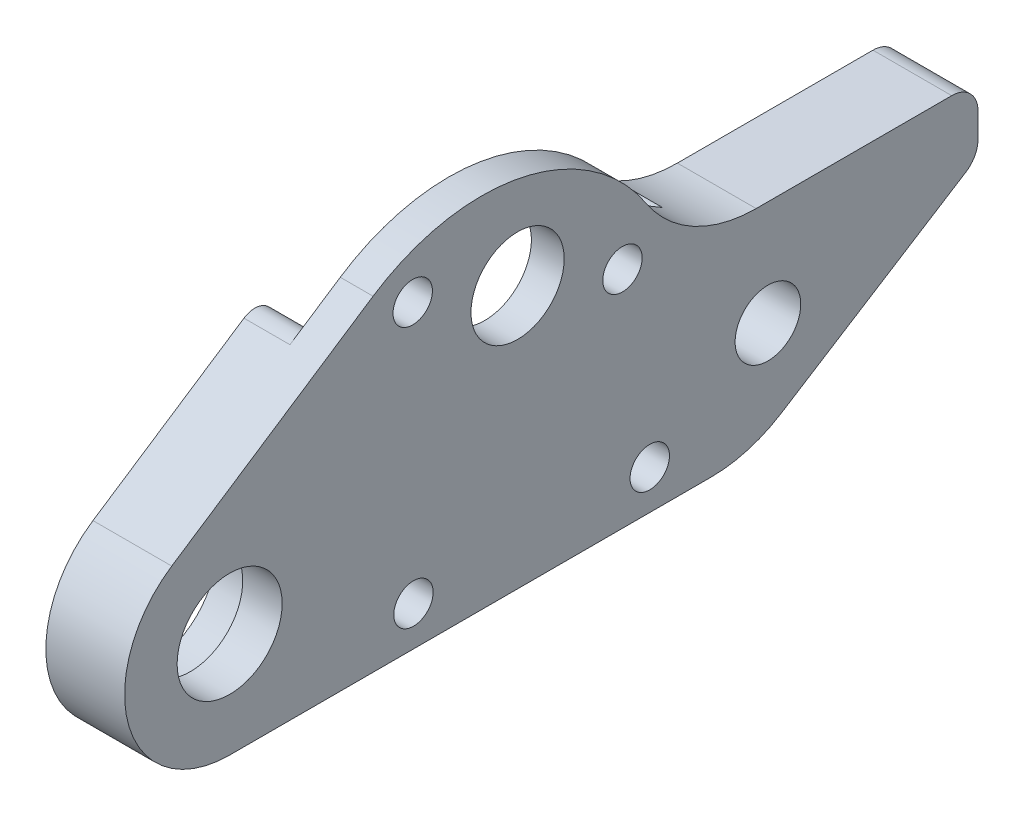
ISO-10303-21;
HEADER;
FILE_DESCRIPTION(('STEP AP214'),'2;1');
FILE_NAME('part.step','',(''),(''),'','','');
FILE_SCHEMA(('AUTOMOTIVE_DESIGN { 1 0 10303 214 1 1 1 1 }'));
ENDSEC;
DATA;
#1=APPLICATION_CONTEXT('core data for automotive mechanical design processes');
#2=APPLICATION_PROTOCOL_DEFINITION('international standard','automotive_design',2000,#1);
#3=PRODUCT_CONTEXT('',#1,'mechanical');
#4=PRODUCT('Part','Part','',(#3));
#5=PRODUCT_RELATED_PRODUCT_CATEGORY('part','',(#4));
#6=PRODUCT_DEFINITION_FORMATION('','',#4);
#7=PRODUCT_DEFINITION_CONTEXT('part definition',#1,'design');
#8=PRODUCT_DEFINITION('design','',#6,#7);
#9=PRODUCT_DEFINITION_SHAPE('','',#8);
#10=(LENGTH_UNIT() NAMED_UNIT(*) SI_UNIT(.MILLI.,.METRE.));
#11=(NAMED_UNIT(*) PLANE_ANGLE_UNIT() SI_UNIT($,.RADIAN.));
#12=(NAMED_UNIT(*) SI_UNIT($,.STERADIAN.) SOLID_ANGLE_UNIT());
#13=UNCERTAINTY_MEASURE_WITH_UNIT(LENGTH_MEASURE(1.E-05),#10,'distance_accuracy_value','');
#14=(GEOMETRIC_REPRESENTATION_CONTEXT(3) GLOBAL_UNCERTAINTY_ASSIGNED_CONTEXT((#13)) GLOBAL_UNIT_ASSIGNED_CONTEXT((#10,
#11,#12)) REPRESENTATION_CONTEXT('',''));
#15=CARTESIAN_POINT('',(0.,0.,0.));
#16=DIRECTION('',(0.,0.,1.));
#17=DIRECTION('',(1.,0.,0.));
#18=AXIS2_PLACEMENT_3D('',#15,#16,#17);
#19=CARTESIAN_POINT('',(6.,46.2927620809669,-28.1942750175218));
#20=DIRECTION('',(-1.,0.,0.));
#21=DIRECTION('',(0.,0.,1.));
#22=AXIS2_PLACEMENT_3D('',#19,#20,#21);
#23=CYLINDRICAL_SURFACE('',#22,15.);
#24=CARTESIAN_POINT('',(3.5,46.2927620809669,-28.1942750175218));
#25=DIRECTION('',(-1.,0.,0.));
#26=DIRECTION('',(0.,0.,1.));
#27=AXIS2_PLACEMENT_3D('',#24,#25,#26);
#28=CIRCLE('',#27,15.);
#29=CARTESIAN_POINT('',(3.5,58.8075132063466,-19.9249942586041));
#30=VERTEX_POINT('',#29);
#31=CARTESIAN_POINT('',(3.5,54.5171048323868,-40.7386038679294));
#32=VERTEX_POINT('',#31);
#33=EDGE_CURVE('E269',#30,#32,#28,.T.);
#34=ORIENTED_EDGE('',*,*,#33,.F.);
#35=DIRECTION('',(-1.,0.,0.));
#36=VECTOR('',#35,1.);
#37=CARTESIAN_POINT('',(6.,58.8075132063466,-19.9249942586041));
#38=LINE('',#37,#36);
#39=CARTESIAN_POINT('',(6.,58.8075132063466,-19.9249942586041));
#40=VERTEX_POINT('',#39);
#41=EDGE_CURVE('E334',#40,#30,#38,.T.);
#42=ORIENTED_EDGE('',*,*,#41,.F.);
#43=CARTESIAN_POINT('',(6.,46.2927620809669,-28.1942750175218));
#44=DIRECTION('',(1.,0.,0.));
#45=DIRECTION('',(0.,0.,-1.));
#46=AXIS2_PLACEMENT_3D('',#43,#44,#45);
#47=CIRCLE('',#46,15.);
#48=CARTESIAN_POINT('',(6.,54.5171048323868,-40.7386038679294));
#49=VERTEX_POINT('',#48);
#50=EDGE_CURVE('E314',#49,#40,#47,.T.);
#51=ORIENTED_EDGE('',*,*,#50,.F.);
#52=DIRECTION('',(-1.,0.,0.));
#53=VECTOR('',#52,1.);
#54=CARTESIAN_POINT('',(6.,54.5171048323868,-40.7386038679294));
#55=LINE('',#54,#53);
#56=EDGE_CURVE('E337',#49,#32,#55,.T.);
#57=ORIENTED_EDGE('',*,*,#56,.T.);
#58=EDGE_LOOP('',(#34,#42,#51,#57));
#59=FACE_BOUND('',#58,.T.);
#60=ADVANCED_FACE('F35',(#59),#23,.T.);
#61=CARTESIAN_POINT('',(6.,48.6745339335359,-4.58971692857723));
#62=DIRECTION('',(0.,-0.834316741691982,-0.551285383927847));
#63=DIRECTION('',(0.,0.551285383927847,-0.834316741691982));
#64=AXIS2_PLACEMENT_3D('',#61,#62,#63);
#65=PLANE('',#64);
#66=DIRECTION('',(-1.,0.,0.));
#67=VECTOR('',#66,1.);
#68=CARTESIAN_POINT('',(3.5,56.2748839326005,-16.0921064926876));
#69=LINE('',#68,#67);
#70=CARTESIAN_POINT('',(3.5,56.2748839326005,-16.0921064926876));
#71=VERTEX_POINT('',#70);
#72=CARTESIAN_POINT('',(0.,56.2748839326005,-16.0921064926876));
#73=VERTEX_POINT('',#72);
#74=EDGE_CURVE('E255',#71,#73,#69,.T.);
#75=ORIENTED_EDGE('',*,*,#74,.T.);
#76=DIRECTION('',(0.,-0.551285383927847,0.834316741691982));
#77=VECTOR('',#76,1.);
#78=CARTESIAN_POINT('',(0.,48.6745339335359,-4.58971692857723));
#79=LINE('',#78,#77);
#80=CARTESIAN_POINT('',(0.,48.6745339335359,-4.58971692857723));
#81=VERTEX_POINT('',#80);
#82=EDGE_CURVE('E303',#73,#81,#79,.T.);
#83=ORIENTED_EDGE('',*,*,#82,.T.);
#84=DIRECTION('',(-1.,0.,0.));
#85=VECTOR('',#84,1.);
#86=CARTESIAN_POINT('',(6.,48.6745339335359,-4.58971692857723));
#87=LINE('',#86,#85);
#88=CARTESIAN_POINT('',(6.,48.6745339335359,-4.58971692857723));
#89=VERTEX_POINT('',#88);
#90=EDGE_CURVE('E318',#89,#81,#87,.T.);
#91=ORIENTED_EDGE('',*,*,#90,.F.);
#92=DIRECTION('',(0.,-0.551285383927847,0.834316741691982));
#93=VECTOR('',#92,1.);
#94=CARTESIAN_POINT('',(6.,48.6745339335359,-4.58971692857723));
#95=LINE('',#94,#93);
#96=EDGE_CURVE('E316',#40,#89,#95,.T.);
#97=ORIENTED_EDGE('',*,*,#96,.F.);
#98=ORIENTED_EDGE('',*,*,#41,.T.);
#99=DIRECTION('',(0.,0.551285383927848,-0.834316741691982));
#100=VECTOR('',#99,1.);
#101=CARTESIAN_POINT('',(3.5,65.3675012269774,-29.8528972839225));
#102=LINE('',#101,#100);
#103=EDGE_CURVE('E248',#71,#30,#102,.T.);
#104=ORIENTED_EDGE('',*,*,#103,.F.);
#105=EDGE_LOOP('',(#75,#83,#91,#97,#98,#104));
#106=FACE_BOUND('',#105,.T.);
#107=ADVANCED_FACE('F498',(#106),#65,.F.);
#108=CARTESIAN_POINT('',(6.,54.,-30.9317121994613));
#109=DIRECTION('',(-1.,0.,0.));
#110=DIRECTION('',(0.,0.,1.));
#111=AXIS2_PLACEMENT_3D('',#108,#109,#110);
#112=CYLINDRICAL_SURFACE('',#111,3.54999999999999);
#113=CARTESIAN_POINT('',(6.,54.,-30.9317121994613));
#114=DIRECTION('',(1.,0.,0.));
#115=DIRECTION('',(0.,0.,-1.));
#116=AXIS2_PLACEMENT_3D('',#113,#114,#115);
#117=CIRCLE('',#116,3.54999999999999);
#118=CARTESIAN_POINT('',(6.,54.,-34.4817121994613));
#119=VERTEX_POINT('',#118);
#120=EDGE_CURVE('E295',#119,#119,#117,.T.);
#121=ORIENTED_EDGE('',*,*,#120,.T.);
#122=EDGE_LOOP('',(#121));
#123=FACE_BOUND('',#122,.T.);
#124=CARTESIAN_POINT('',(3.5,54.,-30.9317121994613));
#125=DIRECTION('',(-1.,0.,0.));
#126=DIRECTION('',(0.,0.,1.));
#127=AXIS2_PLACEMENT_3D('',#124,#125,#126);
#128=CIRCLE('',#127,3.54999999999999);
#129=CARTESIAN_POINT('',(3.5,54.,-27.3817121994613));
#130=VERTEX_POINT('',#129);
#131=EDGE_CURVE('E266',#130,#130,#128,.T.);
#132=ORIENTED_EDGE('',*,*,#131,.T.);
#133=EDGE_LOOP('',(#132));
#134=FACE_BOUND('',#133,.T.);
#135=ADVANCED_FACE('F504',(#123,#134),#112,.F.);
#136=CARTESIAN_POINT('',(6.,51.0928287817318,-38.9190994761415));
#137=DIRECTION('',(-1.,0.,0.));
#138=DIRECTION('',(0.,0.,1.));
#139=AXIS2_PLACEMENT_3D('',#136,#137,#138);
#140=CYLINDRICAL_SURFACE('',#139,1.5);
#141=CARTESIAN_POINT('',(6.,51.0928287817318,-38.9190994761415));
#142=DIRECTION('',(1.,0.,0.));
#143=DIRECTION('',(0.,0.,-1.));
#144=AXIS2_PLACEMENT_3D('',#141,#142,#143);
#145=CIRCLE('',#144,1.5);
#146=CARTESIAN_POINT('',(6.,51.0928287817318,-40.4190994761415));
#147=VERTEX_POINT('',#146);
#148=EDGE_CURVE('E292',#147,#147,#145,.T.);
#149=ORIENTED_EDGE('',*,*,#148,.T.);
#150=EDGE_LOOP('',(#149));
#151=FACE_BOUND('',#150,.T.);
#152=CARTESIAN_POINT('',(3.5,51.0928287817318,-38.9190994761415));
#153=DIRECTION('',(-1.,0.,0.));
#154=DIRECTION('',(0.,0.,1.));
#155=AXIS2_PLACEMENT_3D('',#152,#153,#154);
#156=CIRCLE('',#155,1.5);
#157=CARTESIAN_POINT('',(3.5,51.0928287817318,-37.4190994761415));
#158=VERTEX_POINT('',#157);
#159=EDGE_CURVE('E263',#158,#158,#156,.T.);
#160=ORIENTED_EDGE('',*,*,#159,.T.);
#161=EDGE_LOOP('',(#160));
#162=FACE_BOUND('',#161,.T.);
#163=ADVANCED_FACE('F744',(#151,#162),#140,.F.);
#164=CARTESIAN_POINT('',(6.,56.9071712182682,-22.9443249227811));
#165=DIRECTION('',(-1.,0.,0.));
#166=DIRECTION('',(0.,0.,1.));
#167=AXIS2_PLACEMENT_3D('',#164,#165,#166);
#168=CYLINDRICAL_SURFACE('',#167,1.5);
#169=CARTESIAN_POINT('',(6.,56.9071712182682,-22.9443249227811));
#170=DIRECTION('',(1.,0.,0.));
#171=DIRECTION('',(0.,0.,-1.));
#172=AXIS2_PLACEMENT_3D('',#169,#170,#171);
#173=CIRCLE('',#172,1.5);
#174=CARTESIAN_POINT('',(6.,56.9071712182682,-24.4443249227811));
#175=VERTEX_POINT('',#174);
#176=EDGE_CURVE('E289',#175,#175,#173,.T.);
#177=ORIENTED_EDGE('',*,*,#176,.T.);
#178=EDGE_LOOP('',(#177));
#179=FACE_BOUND('',#178,.T.);
#180=CARTESIAN_POINT('',(3.5,56.9071712182682,-22.9443249227811));
#181=DIRECTION('',(-1.,0.,0.));
#182=DIRECTION('',(0.,0.,1.));
#183=AXIS2_PLACEMENT_3D('',#180,#181,#182);
#184=CIRCLE('',#183,1.5);
#185=CARTESIAN_POINT('',(3.5,56.9071712182682,-21.4443249227811));
#186=VERTEX_POINT('',#185);
#187=EDGE_CURVE('E258',#186,#186,#184,.T.);
#188=ORIENTED_EDGE('',*,*,#187,.T.);
#189=EDGE_LOOP('',(#188));
#190=FACE_BOUND('',#189,.T.);
#191=ADVANCED_FACE('F739',(#179,#190),#168,.F.);
#192=CARTESIAN_POINT('',(6.,42.,-9.));
#193=DIRECTION('',(-1.,0.,0.));
#194=DIRECTION('',(0.,0.,1.));
#195=AXIS2_PLACEMENT_3D('',#192,#193,#194);
#196=CYLINDRICAL_SURFACE('',#195,4.);
#197=CARTESIAN_POINT('',(6.,42.,-9.));
#198=DIRECTION('',(1.,0.,0.));
#199=DIRECTION('',(0.,0.,-1.));
#200=AXIS2_PLACEMENT_3D('',#197,#198,#199);
#201=CIRCLE('',#200,4.);
#202=CARTESIAN_POINT('',(6.,42.,-13.));
#203=VERTEX_POINT('',#202);
#204=EDGE_CURVE('E283',#203,#203,#201,.T.);
#205=ORIENTED_EDGE('',*,*,#204,.T.);
#206=EDGE_LOOP('',(#205));
#207=FACE_BOUND('',#206,.T.);
#208=CARTESIAN_POINT('',(3.,42.,-9.));
#209=DIRECTION('',(-1.,0.,0.));
#210=DIRECTION('',(0.,0.,1.));
#211=AXIS2_PLACEMENT_3D('',#208,#209,#210);
#212=CIRCLE('',#211,4.);
#213=CARTESIAN_POINT('',(3.,42.,-5.));
#214=VERTEX_POINT('',#213);
#215=EDGE_CURVE('E277',#214,#214,#212,.T.);
#216=ORIENTED_EDGE('',*,*,#215,.T.);
#217=EDGE_LOOP('',(#216));
#218=FACE_BOUND('',#217,.T.);
#219=ADVANCED_FACE('F588',(#207,#218),#196,.F.);
#220=CARTESIAN_POINT('',(6.,42.,-9.));
#221=DIRECTION('',(1.,0.,0.));
#222=DIRECTION('',(0.,0.,-1.));
#223=AXIS2_PLACEMENT_3D('',#220,#221,#222);
#224=PLANE('',#223);
#225=CARTESIAN_POINT('',(6.,37.,-23.));
#226=DIRECTION('',(1.,0.,0.));
#227=DIRECTION('',(0.,0.,-1.));
#228=AXIS2_PLACEMENT_3D('',#225,#226,#227);
#229=CIRCLE('',#228,1.5);
#230=CARTESIAN_POINT('',(6.,37.,-24.5));
#231=VERTEX_POINT('',#230);
#232=EDGE_CURVE('E467',#231,#231,#229,.F.);
#233=ORIENTED_EDGE('',*,*,#232,.T.);
#234=EDGE_LOOP('',(#233));
#235=FACE_BOUND('',#234,.T.);
#236=CARTESIAN_POINT('',(6.,37.,-41.));
#237=DIRECTION('',(1.,0.,0.));
#238=DIRECTION('',(0.,0.,-1.));
#239=AXIS2_PLACEMENT_3D('',#236,#237,#238);
#240=CIRCLE('',#239,1.5);
#241=CARTESIAN_POINT('',(6.,37.,-42.5));
#242=VERTEX_POINT('',#241);
#243=EDGE_CURVE('E461',#242,#242,#240,.F.);
#244=ORIENTED_EDGE('',*,*,#243,.T.);
#245=EDGE_LOOP('',(#244));
#246=FACE_BOUND('',#245,.T.);
#247=ORIENTED_EDGE('',*,*,#204,.F.);
#248=EDGE_LOOP('',(#247));
#249=FACE_BOUND('',#248,.T.);
#250=ORIENTED_EDGE('',*,*,#148,.F.);
#251=EDGE_LOOP('',(#250));
#252=FACE_BOUND('',#251,.T.);
#253=DIRECTION('',(0.,1.,0.));
#254=VECTOR('',#253,1.);
#255=CARTESIAN_POINT('',(6.,45.,-66.));
#256=LINE('',#255,#254);
#257=CARTESIAN_POINT('',(6.,46.1029769045838,-66.));
#258=VERTEX_POINT('',#257);
#259=CARTESIAN_POINT('',(6.,48.,-66.));
#260=VERTEX_POINT('',#259);
#261=EDGE_CURVE('E308',#258,#260,#256,.T.);
#262=ORIENTED_EDGE('',*,*,#261,.T.);
#263=CARTESIAN_POINT('',(6.,48.,-64.));
#264=DIRECTION('',(1.,0.,0.));
#265=DIRECTION('',(0.,0.,-1.));
#266=AXIS2_PLACEMENT_3D('',#263,#264,#265);
#267=CIRCLE('',#266,2.);
#268=CARTESIAN_POINT('',(6.,50.,-64.));
#269=VERTEX_POINT('',#268);
#270=EDGE_CURVE('E43',#260,#269,#267,.T.);
#271=ORIENTED_EDGE('',*,*,#270,.T.);
#272=DIRECTION('',(0.,0.,1.));
#273=VECTOR('',#272,1.);
#274=CARTESIAN_POINT('',(6.,50.,-66.));
#275=LINE('',#274,#273);
#276=CARTESIAN_POINT('',(6.,50.,-49.1014897682011));
#277=VERTEX_POINT('',#276);
#278=EDGE_CURVE('E310',#269,#277,#275,.T.);
#279=ORIENTED_EDGE('',*,*,#278,.T.);
#280=CARTESIAN_POINT('',(6.,60.,-49.1014897682011));
#281=DIRECTION('',(-1.,0.,0.));
#282=DIRECTION('',(0.,0.,1.));
#283=AXIS2_PLACEMENT_3D('',#280,#281,#282);
#284=CIRCLE('',#283,10.);
#285=EDGE_CURVE('E312',#277,#49,#284,.T.);
#286=ORIENTED_EDGE('',*,*,#285,.T.);
#287=ORIENTED_EDGE('',*,*,#50,.T.);
#288=ORIENTED_EDGE('',*,*,#96,.T.);
#289=CARTESIAN_POINT('',(6.,42.,-9.));
#290=DIRECTION('',(1.,0.,0.));
#291=DIRECTION('',(0.,0.,-1.));
#292=AXIS2_PLACEMENT_3D('',#289,#290,#291);
#293=CIRCLE('',#292,8.);
#294=CARTESIAN_POINT('',(6.,34.,-9.));
#295=VERTEX_POINT('',#294);
#296=EDGE_CURVE('E299',#89,#295,#293,.T.);
#297=ORIENTED_EDGE('',*,*,#296,.T.);
#298=DIRECTION('',(0.,0.,-1.));
#299=VECTOR('',#298,1.);
#300=CARTESIAN_POINT('',(6.,34.,-48.5643987878585));
#301=LINE('',#300,#299);
#302=CARTESIAN_POINT('',(6.,34.,-45.6735519559303));
#303=VERTEX_POINT('',#302);
#304=EDGE_CURVE('E302',#295,#303,#301,.T.);
#305=ORIENTED_EDGE('',*,*,#304,.T.);
#306=CARTESIAN_POINT('',(6.,44.,-45.6735519559303));
#307=DIRECTION('',(1.,0.,0.));
#308=DIRECTION('',(0.,0.,-1.));
#309=AXIS2_PLACEMENT_3D('',#306,#307,#308);
#310=CIRCLE('',#309,10.);
#311=CARTESIAN_POINT('',(6.,35.5424930110662,-51.0093345163554));
#312=VERTEX_POINT('',#311);
#313=EDGE_CURVE('E393',#303,#312,#310,.T.);
#314=ORIENTED_EDGE('',*,*,#313,.T.);
#315=DIRECTION('',(0.,0.533578256042509,-0.845750698893377));
#316=VECTOR('',#315,1.);
#317=CARTESIAN_POINT('',(6.,34.,-48.5643987878585));
#318=LINE('',#317,#316);
#319=CARTESIAN_POINT('',(6.,44.411475506797,-65.067156512085));
#320=VERTEX_POINT('',#319);
#321=EDGE_CURVE('E306',#312,#320,#318,.T.);
#322=ORIENTED_EDGE('',*,*,#321,.T.);
#323=CARTESIAN_POINT('',(6.,46.1029769045838,-64.));
#324=DIRECTION('',(1.,0.,0.));
#325=DIRECTION('',(0.,0.,-1.));
#326=AXIS2_PLACEMENT_3D('',#323,#324,#325);
#327=CIRCLE('',#326,2.);
#328=EDGE_CURVE('E406',#320,#258,#327,.T.);
#329=ORIENTED_EDGE('',*,*,#328,.T.);
#330=EDGE_LOOP('',(#262,#271,#279,#286,#287,#288,#297,#305,#314,#322,#329));
#331=FACE_BOUND('',#330,.T.);
#332=ORIENTED_EDGE('',*,*,#120,.F.);
#333=EDGE_LOOP('',(#332));
#334=FACE_BOUND('',#333,.T.);
#335=ORIENTED_EDGE('',*,*,#176,.F.);
#336=EDGE_LOOP('',(#335));
#337=FACE_BOUND('',#336,.T.);
#338=CARTESIAN_POINT('',(6.,42.,-50.));
#339=DIRECTION('',(1.,0.,0.));
#340=DIRECTION('',(0.,0.,-1.));
#341=AXIS2_PLACEMENT_3D('',#338,#339,#340);
#342=CIRCLE('',#341,2.5);
#343=CARTESIAN_POINT('',(6.,42.,-52.5));
#344=VERTEX_POINT('',#343);
#345=EDGE_CURVE('E280',#344,#344,#342,.T.);
#346=ORIENTED_EDGE('',*,*,#345,.F.);
#347=EDGE_LOOP('',(#346));
#348=FACE_BOUND('',#347,.T.);
#349=ADVANCED_FACE('F410',(#235,#246,#249,#252,#331,#334,#337,#348),#224,.T.);
#350=CARTESIAN_POINT('',(0.,42.,-9.));
#351=DIRECTION('',(1.,0.,0.));
#352=DIRECTION('',(0.,0.,-1.));
#353=AXIS2_PLACEMENT_3D('',#350,#351,#352);
#354=PLANE('',#353);
#355=CARTESIAN_POINT('',(0.,42.,-9.));
#356=DIRECTION('',(-1.,0.,0.));
#357=DIRECTION('',(0.,0.,1.));
#358=AXIS2_PLACEMENT_3D('',#355,#356,#357);
#359=CIRCLE('',#358,4.99);
#360=CARTESIAN_POINT('',(0.,42.,-4.01));
#361=VERTEX_POINT('',#360);
#362=EDGE_CURVE('E273',#361,#361,#359,.T.);
#363=ORIENTED_EDGE('',*,*,#362,.F.);
#364=EDGE_LOOP('',(#363));
#365=FACE_BOUND('',#364,.T.);
#366=DIRECTION('',(0.,0.,1.));
#367=VECTOR('',#366,1.);
#368=CARTESIAN_POINT('',(0.,50.,-66.));
#369=LINE('',#368,#367);
#370=CARTESIAN_POINT('',(0.,50.,-64.));
#371=VERTEX_POINT('',#370);
#372=CARTESIAN_POINT('',(0.,50.,-49.1014897682011));
#373=VERTEX_POINT('',#372);
#374=EDGE_CURVE('E327',#371,#373,#369,.T.);
#375=ORIENTED_EDGE('',*,*,#374,.F.);
#376=CARTESIAN_POINT('',(0.,48.,-64.));
#377=DIRECTION('',(1.,0.,0.));
#378=DIRECTION('',(0.,0.,-1.));
#379=AXIS2_PLACEMENT_3D('',#376,#377,#378);
#380=CIRCLE('',#379,2.);
#381=CARTESIAN_POINT('',(0.,48.,-66.));
#382=VERTEX_POINT('',#381);
#383=EDGE_CURVE('E400',#371,#382,#380,.F.);
#384=ORIENTED_EDGE('',*,*,#383,.T.);
#385=DIRECTION('',(0.,1.,0.));
#386=VECTOR('',#385,1.);
#387=CARTESIAN_POINT('',(0.,45.,-66.));
#388=LINE('',#387,#386);
#389=CARTESIAN_POINT('',(0.,46.1029769045838,-66.));
#390=VERTEX_POINT('',#389);
#391=EDGE_CURVE('E325',#390,#382,#388,.T.);
#392=ORIENTED_EDGE('',*,*,#391,.F.);
#393=CARTESIAN_POINT('',(0.,46.1029769045838,-64.));
#394=DIRECTION('',(1.,0.,0.));
#395=DIRECTION('',(0.,0.,-1.));
#396=AXIS2_PLACEMENT_3D('',#393,#394,#395);
#397=CIRCLE('',#396,2.);
#398=CARTESIAN_POINT('',(0.,44.411475506797,-65.067156512085));
#399=VERTEX_POINT('',#398);
#400=EDGE_CURVE('E398',#390,#399,#397,.F.);
#401=ORIENTED_EDGE('',*,*,#400,.T.);
#402=DIRECTION('',(0.,0.533578256042509,-0.845750698893377));
#403=VECTOR('',#402,1.);
#404=CARTESIAN_POINT('',(0.,34.,-48.5643987878585));
#405=LINE('',#404,#403);
#406=CARTESIAN_POINT('',(0.,35.5424930110662,-51.0093345163554));
#407=VERTEX_POINT('',#406);
#408=EDGE_CURVE('E323',#407,#399,#405,.T.);
#409=ORIENTED_EDGE('',*,*,#408,.F.);
#410=CARTESIAN_POINT('',(0.,44.,-45.6735519559303));
#411=DIRECTION('',(1.,0.,0.));
#412=DIRECTION('',(0.,0.,-1.));
#413=AXIS2_PLACEMENT_3D('',#410,#411,#412);
#414=CIRCLE('',#413,10.);
#415=CARTESIAN_POINT('',(0.,34.,-45.6735519559303));
#416=VERTEX_POINT('',#415);
#417=EDGE_CURVE('E389',#407,#416,#414,.F.);
#418=ORIENTED_EDGE('',*,*,#417,.T.);
#419=DIRECTION('',(0.,0.,-1.));
#420=VECTOR('',#419,1.);
#421=CARTESIAN_POINT('',(0.,34.,-48.5643987878585));
#422=LINE('',#421,#420);
#423=CARTESIAN_POINT('',(0.,34.,-44.));
#424=VERTEX_POINT('',#423);
#425=EDGE_CURVE('E321',#424,#416,#422,.T.);
#426=ORIENTED_EDGE('',*,*,#425,.F.);
#427=DIRECTION('',(0.,-1.,0.));
#428=VECTOR('',#427,1.);
#429=CARTESIAN_POINT('',(0.,34.,-44.));
#430=LINE('',#429,#428);
#431=CARTESIAN_POINT('',(0.,36.9384471871912,-44.));
#432=VERTEX_POINT('',#431);
#433=EDGE_CURVE('E441',#432,#424,#430,.T.);
#434=ORIENTED_EDGE('',*,*,#433,.F.);
#435=CARTESIAN_POINT('',(0.,36.9384471871912,-47.));
#436=DIRECTION('',(1.,0.,0.));
#437=DIRECTION('',(0.,0.,-1.));
#438=AXIS2_PLACEMENT_3D('',#435,#436,#437);
#439=CIRCLE('',#438,3.);
#440=CARTESIAN_POINT('',(0.,38.3128157290637,-44.3333333333333));
#441=VERTEX_POINT('',#440);
#442=EDGE_CURVE('E357',#432,#441,#439,.F.);
#443=ORIENTED_EDGE('',*,*,#442,.T.);
#444=CARTESIAN_POINT('',(0.,39.,-43.));
#445=DIRECTION('',(-1.,0.,0.));
#446=DIRECTION('',(0.,0.,1.));
#447=AXIS2_PLACEMENT_3D('',#444,#445,#446);
#448=CIRCLE('',#447,1.5);
#449=CARTESIAN_POINT('',(0.,40.3333333333333,-42.3128157290637));
#450=VERTEX_POINT('',#449);
#451=EDGE_CURVE('E446',#450,#441,#448,.T.);
#452=ORIENTED_EDGE('',*,*,#451,.F.);
#453=CARTESIAN_POINT('',(0.,43.,-40.9384471871912));
#454=DIRECTION('',(1.,0.,0.));
#455=DIRECTION('',(0.,0.,-1.));
#456=AXIS2_PLACEMENT_3D('',#453,#454,#455);
#457=CIRCLE('',#456,3.);
#458=CARTESIAN_POINT('',(0.,40.,-40.9384471871912));
#459=VERTEX_POINT('',#458);
#460=EDGE_CURVE('E359',#450,#459,#457,.F.);
#461=ORIENTED_EDGE('',*,*,#460,.T.);
#462=DIRECTION('',(0.,0.,-1.));
#463=VECTOR('',#462,1.);
#464=CARTESIAN_POINT('',(0.,40.,-44.));
#465=LINE('',#464,#463);
#466=CARTESIAN_POINT('',(0.,40.,-23.0615528128088));
#467=VERTEX_POINT('',#466);
#468=EDGE_CURVE('E237',#467,#459,#465,.T.);
#469=ORIENTED_EDGE('',*,*,#468,.F.);
#470=CARTESIAN_POINT('',(0.,43.,-23.0615528128088));
#471=DIRECTION('',(1.,0.,0.));
#472=DIRECTION('',(0.,0.,-1.));
#473=AXIS2_PLACEMENT_3D('',#470,#471,#472);
#474=CIRCLE('',#473,3.);
#475=CARTESIAN_POINT('',(0.,40.3333333333333,-21.6871842709363));
#476=VERTEX_POINT('',#475);
#477=EDGE_CURVE('E361',#467,#476,#474,.F.);
#478=ORIENTED_EDGE('',*,*,#477,.T.);
#479=CARTESIAN_POINT('',(0.,39.,-21.));
#480=DIRECTION('',(-1.,0.,0.));
#481=DIRECTION('',(0.,0.,1.));
#482=AXIS2_PLACEMENT_3D('',#479,#480,#481);
#483=CIRCLE('',#482,1.5);
#484=CARTESIAN_POINT('',(0.,38.3128157290637,-19.6666666666667));
#485=VERTEX_POINT('',#484);
#486=EDGE_CURVE('E457',#485,#476,#483,.T.);
#487=ORIENTED_EDGE('',*,*,#486,.F.);
#488=CARTESIAN_POINT('',(0.,36.9384471871912,-17.));
#489=DIRECTION('',(1.,0.,0.));
#490=DIRECTION('',(0.,0.,-1.));
#491=AXIS2_PLACEMENT_3D('',#488,#489,#490);
#492=CIRCLE('',#491,3.);
#493=CARTESIAN_POINT('',(0.,36.9384471871912,-20.));
#494=VERTEX_POINT('',#493);
#495=EDGE_CURVE('E363',#485,#494,#492,.F.);
#496=ORIENTED_EDGE('',*,*,#495,.T.);
#497=DIRECTION('',(0.,1.,0.));
#498=VECTOR('',#497,1.);
#499=CARTESIAN_POINT('',(0.,34.,-20.));
#500=LINE('',#499,#498);
#501=CARTESIAN_POINT('',(0.,34.,-20.));
#502=VERTEX_POINT('',#501);
#503=EDGE_CURVE('E442',#502,#494,#500,.T.);
#504=ORIENTED_EDGE('',*,*,#503,.F.);
#505=CARTESIAN_POINT('',(0.,34.,-9.));
#506=VERTEX_POINT('',#505);
#507=EDGE_CURVE('E229',#506,#502,#422,.T.);
#508=ORIENTED_EDGE('',*,*,#507,.F.);
#509=CARTESIAN_POINT('',(0.,42.,-9.));
#510=DIRECTION('',(1.,0.,0.));
#511=DIRECTION('',(0.,0.,-1.));
#512=AXIS2_PLACEMENT_3D('',#509,#510,#511);
#513=CIRCLE('',#512,8.);
#514=EDGE_CURVE('E298',#81,#506,#513,.T.);
#515=ORIENTED_EDGE('',*,*,#514,.F.);
#516=ORIENTED_EDGE('',*,*,#82,.F.);
#517=CARTESIAN_POINT('',(0.,55.0234088200625,-16.9190345685794));
#518=DIRECTION('',(1.,0.,0.));
#519=DIRECTION('',(0.,0.,-1.));
#520=AXIS2_PLACEMENT_3D('',#517,#518,#519);
#521=CIRCLE('',#520,1.5);
#522=CARTESIAN_POINT('',(0.,54.914148091942,-18.4150499740116));
#523=VERTEX_POINT('',#522);
#524=EDGE_CURVE('E243',#523,#73,#521,.T.);
#525=ORIENTED_EDGE('',*,*,#524,.F.);
#526=CARTESIAN_POINT('',(0.,54.,-30.9317121994613));
#527=DIRECTION('',(-1.,0.,0.));
#528=DIRECTION('',(0.,0.,1.));
#529=AXIS2_PLACEMENT_3D('',#526,#527,#528);
#530=CIRCLE('',#529,12.55);
#531=CARTESIAN_POINT('',(0.,50.115850296035,-42.8655247116968));
#532=VERTEX_POINT('',#531);
#533=EDGE_CURVE('E233',#532,#523,#530,.T.);
#534=ORIENTED_EDGE('',*,*,#533,.F.);
#535=CARTESIAN_POINT('',(0.,49.6516092955611,-44.2918768047927));
#536=DIRECTION('',(1.,0.,0.));
#537=DIRECTION('',(0.,0.,1.));
#538=AXIS2_PLACEMENT_3D('',#535,#536,#537);
#539=CIRCLE('',#538,1.5);
#540=CARTESIAN_POINT('',(0.,51.1420832434387,-44.4606589445413));
#541=VERTEX_POINT('',#540);
#542=EDGE_CURVE('E230',#541,#532,#539,.T.);
#543=ORIENTED_EDGE('',*,*,#542,.F.);
#544=CARTESIAN_POINT('',(0.,60.,-49.1014897682011));
#545=DIRECTION('',(-1.,0.,0.));
#546=DIRECTION('',(0.,0.,1.));
#547=AXIS2_PLACEMENT_3D('',#544,#545,#546);
#548=CIRCLE('',#547,10.);
#549=EDGE_CURVE('E329',#373,#541,#548,.T.);
#550=ORIENTED_EDGE('',*,*,#549,.F.);
#551=EDGE_LOOP('',(#375,#384,#392,#401,#409,#418,#426,#434,#443,#452,#461,#469,#478,#487,#496,
#504,#508,#515,#516,#525,#534,#543,#550));
#552=FACE_BOUND('',#551,.T.);
#553=CARTESIAN_POINT('',(0.,42.,-50.));
#554=DIRECTION('',(1.,0.,0.));
#555=DIRECTION('',(0.,0.,-1.));
#556=AXIS2_PLACEMENT_3D('',#553,#554,#555);
#557=CIRCLE('',#556,2.5);
#558=CARTESIAN_POINT('',(0.,42.,-52.5));
#559=VERTEX_POINT('',#558);
#560=EDGE_CURVE('E284',#559,#559,#557,.T.);
#561=ORIENTED_EDGE('',*,*,#560,.T.);
#562=EDGE_LOOP('',(#561));
#563=FACE_BOUND('',#562,.T.);
#564=ADVANCED_FACE('F422',(#365,#552,#563),#354,.F.);
#565=CARTESIAN_POINT('',(6.,42.,-9.));
#566=DIRECTION('',(-1.,0.,0.));
#567=DIRECTION('',(0.,0.,1.));
#568=AXIS2_PLACEMENT_3D('',#565,#566,#567);
#569=CYLINDRICAL_SURFACE('',#568,8.);
#570=ORIENTED_EDGE('',*,*,#514,.T.);
#571=DIRECTION('',(-1.,0.,0.));
#572=VECTOR('',#571,1.);
#573=CARTESIAN_POINT('',(6.,34.,-9.));
#574=LINE('',#573,#572);
#575=EDGE_CURVE('E343',#295,#506,#574,.T.);
#576=ORIENTED_EDGE('',*,*,#575,.F.);
#577=ORIENTED_EDGE('',*,*,#296,.F.);
#578=ORIENTED_EDGE('',*,*,#90,.T.);
#579=EDGE_LOOP('',(#570,#576,#577,#578));
#580=FACE_BOUND('',#579,.T.);
#581=ADVANCED_FACE('F522',(#580),#569,.T.);
#582=CARTESIAN_POINT('',(6.,34.,-48.5643987878585));
#583=DIRECTION('',(0.,1.,0.));
#584=DIRECTION('',(0.,0.,1.));
#585=AXIS2_PLACEMENT_3D('',#582,#583,#584);
#586=PLANE('',#585);
#587=ORIENTED_EDGE('',*,*,#425,.T.);
#588=DIRECTION('',(-1.,0.,0.));
#589=VECTOR('',#588,1.);
#590=CARTESIAN_POINT('',(6.,34.,-45.6735519559303));
#591=LINE('',#590,#589);
#592=EDGE_CURVE('E391',#416,#303,#591,.F.);
#593=ORIENTED_EDGE('',*,*,#592,.T.);
#594=ORIENTED_EDGE('',*,*,#304,.F.);
#595=ORIENTED_EDGE('',*,*,#575,.T.);
#596=ORIENTED_EDGE('',*,*,#507,.T.);
#597=DIRECTION('',(-1.,0.,0.));
#598=VECTOR('',#597,1.);
#599=CARTESIAN_POINT('',(3.,34.,-20.));
#600=LINE('',#599,#598);
#601=CARTESIAN_POINT('',(3.,34.,-20.));
#602=VERTEX_POINT('',#601);
#603=EDGE_CURVE('E209',#602,#502,#600,.T.);
#604=ORIENTED_EDGE('',*,*,#603,.F.);
#605=DIRECTION('',(0.,0.,1.));
#606=VECTOR('',#605,1.);
#607=CARTESIAN_POINT('',(3.,34.,-44.));
#608=LINE('',#607,#606);
#609=CARTESIAN_POINT('',(3.,34.,-44.));
#610=VERTEX_POINT('',#609);
#611=EDGE_CURVE('E215',#610,#602,#608,.T.);
#612=ORIENTED_EDGE('',*,*,#611,.F.);
#613=DIRECTION('',(-1.,0.,0.));
#614=VECTOR('',#613,1.);
#615=CARTESIAN_POINT('',(3.,34.,-44.));
#616=LINE('',#615,#614);
#617=EDGE_CURVE('E231',#610,#424,#616,.T.);
#618=ORIENTED_EDGE('',*,*,#617,.T.);
#619=EDGE_LOOP('',(#587,#593,#594,#595,#596,#604,#612,#618));
#620=FACE_BOUND('',#619,.T.);
#621=ADVANCED_FACE('F227',(#620),#586,.F.);
#622=CARTESIAN_POINT('',(6.,34.,-48.5643987878585));
#623=DIRECTION('',(0.,0.845750698893377,0.533578256042509));
#624=DIRECTION('',(0.,-0.533578256042509,0.845750698893377));
#625=AXIS2_PLACEMENT_3D('',#622,#623,#624);
#626=PLANE('',#625);
#627=ORIENTED_EDGE('',*,*,#408,.T.);
#628=DIRECTION('',(-1.,0.,0.));
#629=VECTOR('',#628,1.);
#630=CARTESIAN_POINT('',(6.,44.411475506797,-65.067156512085));
#631=LINE('',#630,#629);
#632=EDGE_CURVE('E11',#399,#320,#631,.F.);
#633=ORIENTED_EDGE('',*,*,#632,.T.);
#634=ORIENTED_EDGE('',*,*,#321,.F.);
#635=DIRECTION('',(-1.,0.,0.));
#636=VECTOR('',#635,1.);
#637=CARTESIAN_POINT('',(6.,35.5424930110662,-51.0093345163554));
#638=LINE('',#637,#636);
#639=EDGE_CURVE('E386',#312,#407,#638,.T.);
#640=ORIENTED_EDGE('',*,*,#639,.T.);
#641=EDGE_LOOP('',(#627,#633,#634,#640));
#642=FACE_BOUND('',#641,.T.);
#643=ADVANCED_FACE('F430',(#642),#626,.F.);
#644=CARTESIAN_POINT('',(6.,45.,-66.));
#645=DIRECTION('',(0.,0.,1.));
#646=DIRECTION('',(1.,0.,0.));
#647=AXIS2_PLACEMENT_3D('',#644,#645,#646);
#648=PLANE('',#647);
#649=ORIENTED_EDGE('',*,*,#391,.T.);
#650=DIRECTION('',(-1.,0.,0.));
#651=VECTOR('',#650,1.);
#652=CARTESIAN_POINT('',(6.,48.,-66.));
#653=LINE('',#652,#651);
#654=EDGE_CURVE('E56',#382,#260,#653,.F.);
#655=ORIENTED_EDGE('',*,*,#654,.T.);
#656=ORIENTED_EDGE('',*,*,#261,.F.);
#657=DIRECTION('',(-1.,0.,0.));
#658=VECTOR('',#657,1.);
#659=CARTESIAN_POINT('',(6.,46.1029769045838,-66.));
#660=LINE('',#659,#658);
#661=EDGE_CURVE('E402',#258,#390,#660,.T.);
#662=ORIENTED_EDGE('',*,*,#661,.T.);
#663=EDGE_LOOP('',(#649,#655,#656,#662));
#664=FACE_BOUND('',#663,.T.);
#665=ADVANCED_FACE('F425',(#664),#648,.F.);
#666=CARTESIAN_POINT('',(6.,50.,-66.));
#667=DIRECTION('',(0.,-1.,0.));
#668=DIRECTION('',(0.,0.,-1.));
#669=AXIS2_PLACEMENT_3D('',#666,#667,#668);
#670=PLANE('',#669);
#671=ORIENTED_EDGE('',*,*,#278,.F.);
#672=DIRECTION('',(-1.,0.,0.));
#673=VECTOR('',#672,1.);
#674=CARTESIAN_POINT('',(6.,50.,-64.));
#675=LINE('',#674,#673);
#676=EDGE_CURVE('E395',#269,#371,#675,.T.);
#677=ORIENTED_EDGE('',*,*,#676,.T.);
#678=ORIENTED_EDGE('',*,*,#374,.T.);
#679=DIRECTION('',(-1.,0.,0.));
#680=VECTOR('',#679,1.);
#681=CARTESIAN_POINT('',(6.,50.,-49.1014897682011));
#682=LINE('',#681,#680);
#683=EDGE_CURVE('E340',#277,#373,#682,.T.);
#684=ORIENTED_EDGE('',*,*,#683,.F.);
#685=EDGE_LOOP('',(#671,#677,#678,#684));
#686=FACE_BOUND('',#685,.T.);
#687=ADVANCED_FACE('F416',(#686),#670,.F.);
#688=CARTESIAN_POINT('',(6.,60.,-49.1014897682011));
#689=DIRECTION('',(-1.,0.,0.));
#690=DIRECTION('',(0.,0.,1.));
#691=AXIS2_PLACEMENT_3D('',#688,#689,#690);
#692=CYLINDRICAL_SURFACE('',#691,10.);
#693=ORIENTED_EDGE('',*,*,#549,.T.);
#694=DIRECTION('',(-1.,0.,0.));
#695=VECTOR('',#694,1.);
#696=CARTESIAN_POINT('',(1.75,51.1420832434387,-44.4606589445414));
#697=LINE('',#696,#695);
#698=CARTESIAN_POINT('',(3.5,51.1420832434387,-44.4606589445413));
#699=VERTEX_POINT('',#698);
#700=EDGE_CURVE('E345',#541,#699,#697,.F.);
#701=ORIENTED_EDGE('',*,*,#700,.T.);
#702=CARTESIAN_POINT('',(3.5,60.,-49.1014897682011));
#703=DIRECTION('',(-1.,0.,0.));
#704=DIRECTION('',(0.,0.,1.));
#705=AXIS2_PLACEMENT_3D('',#702,#703,#704);
#706=CIRCLE('',#705,10.);
#707=EDGE_CURVE('E271',#32,#699,#706,.F.);
#708=ORIENTED_EDGE('',*,*,#707,.F.);
#709=ORIENTED_EDGE('',*,*,#56,.F.);
#710=ORIENTED_EDGE('',*,*,#285,.F.);
#711=ORIENTED_EDGE('',*,*,#683,.T.);
#712=EDGE_LOOP('',(#693,#701,#708,#709,#710,#711));
#713=FACE_BOUND('',#712,.T.);
#714=ADVANCED_FACE('F509',(#713),#692,.F.);
#715=CARTESIAN_POINT('',(6.,42.,-50.));
#716=DIRECTION('',(-1.,0.,0.));
#717=DIRECTION('',(0.,0.,1.));
#718=AXIS2_PLACEMENT_3D('',#715,#716,#717);
#719=CYLINDRICAL_SURFACE('',#718,2.5);
#720=ORIENTED_EDGE('',*,*,#345,.T.);
#721=EDGE_LOOP('',(#720));
#722=FACE_BOUND('',#721,.T.);
#723=ORIENTED_EDGE('',*,*,#560,.F.);
#724=EDGE_LOOP('',(#723));
#725=FACE_BOUND('',#724,.T.);
#726=ADVANCED_FACE('F512',(#722,#725),#719,.F.);
#727=CARTESIAN_POINT('',(3.,42.,-9.));
#728=DIRECTION('',(-1.,0.,0.));
#729=DIRECTION('',(0.,0.,1.));
#730=AXIS2_PLACEMENT_3D('',#727,#728,#729);
#731=CYLINDRICAL_SURFACE('',#730,4.99);
#732=CARTESIAN_POINT('',(3.,42.,-9.));
#733=DIRECTION('',(-1.,0.,0.));
#734=DIRECTION('',(0.,0.,1.));
#735=AXIS2_PLACEMENT_3D('',#732,#733,#734);
#736=CIRCLE('',#735,4.99);
#737=CARTESIAN_POINT('',(3.,42.,-4.01));
#738=VERTEX_POINT('',#737);
#739=EDGE_CURVE('E274',#738,#738,#736,.T.);
#740=ORIENTED_EDGE('',*,*,#739,.F.);
#741=EDGE_LOOP('',(#740));
#742=FACE_BOUND('',#741,.T.);
#743=ORIENTED_EDGE('',*,*,#362,.T.);
#744=EDGE_LOOP('',(#743));
#745=FACE_BOUND('',#744,.T.);
#746=ADVANCED_FACE('F780',(#742,#745),#731,.F.);
#747=CARTESIAN_POINT('',(3.,42.,-9.));
#748=DIRECTION('',(-1.,0.,0.));
#749=DIRECTION('',(0.,0.,1.));
#750=AXIS2_PLACEMENT_3D('',#747,#748,#749);
#751=PLANE('',#750);
#752=ORIENTED_EDGE('',*,*,#215,.F.);
#753=EDGE_LOOP('',(#752));
#754=FACE_BOUND('',#753,.T.);
#755=ORIENTED_EDGE('',*,*,#739,.T.);
#756=EDGE_LOOP('',(#755));
#757=FACE_BOUND('',#756,.T.);
#758=ADVANCED_FACE('F724',(#754,#757),#751,.T.);
#759=CARTESIAN_POINT('',(3.5,49.6516092955611,-44.2918768047927));
#760=DIRECTION('',(-1.,0.,0.));
#761=DIRECTION('',(0.,0.,1.));
#762=AXIS2_PLACEMENT_3D('',#759,#760,#761);
#763=CYLINDRICAL_SURFACE('',#762,1.5);
#764=ORIENTED_EDGE('',*,*,#542,.T.);
#765=DIRECTION('',(-1.,0.,0.));
#766=VECTOR('',#765,1.);
#767=CARTESIAN_POINT('',(3.5,50.115850296035,-42.8655247116968));
#768=LINE('',#767,#766);
#769=CARTESIAN_POINT('',(3.5,50.115850296035,-42.8655247116968));
#770=VERTEX_POINT('',#769);
#771=EDGE_CURVE('E250',#770,#532,#768,.T.);
#772=ORIENTED_EDGE('',*,*,#771,.F.);
#773=CARTESIAN_POINT('',(3.5,49.6516092955611,-44.2918768047927));
#774=DIRECTION('',(1.,0.,0.));
#775=DIRECTION('',(0.,0.,1.));
#776=AXIS2_PLACEMENT_3D('',#773,#774,#775);
#777=CIRCLE('',#776,1.5);
#778=EDGE_CURVE('E240',#699,#770,#777,.T.);
#779=ORIENTED_EDGE('',*,*,#778,.F.);
#780=ORIENTED_EDGE('',*,*,#700,.F.);
#781=EDGE_LOOP('',(#764,#772,#779,#780));
#782=FACE_BOUND('',#781,.T.);
#783=ADVANCED_FACE('F714',(#782),#763,.T.);
#784=CARTESIAN_POINT('',(3.5,49.6516092955611,-44.2918768047927));
#785=DIRECTION('',(-1.,0.,0.));
#786=DIRECTION('',(0.,0.,1.));
#787=AXIS2_PLACEMENT_3D('',#784,#785,#786);
#788=PLANE('',#787);
#789=ORIENTED_EDGE('',*,*,#131,.F.);
#790=EDGE_LOOP('',(#789));
#791=FACE_BOUND('',#790,.T.);
#792=ORIENTED_EDGE('',*,*,#159,.F.);
#793=EDGE_LOOP('',(#792));
#794=FACE_BOUND('',#793,.T.);
#795=ORIENTED_EDGE('',*,*,#187,.F.);
#796=EDGE_LOOP('',(#795));
#797=FACE_BOUND('',#796,.T.);
#798=ORIENTED_EDGE('',*,*,#707,.T.);
#799=ORIENTED_EDGE('',*,*,#778,.T.);
#800=CARTESIAN_POINT('',(3.5,54.,-30.9317121994613));
#801=DIRECTION('',(-1.,0.,0.));
#802=DIRECTION('',(0.,0.,1.));
#803=AXIS2_PLACEMENT_3D('',#800,#801,#802);
#804=CIRCLE('',#803,12.55);
#805=CARTESIAN_POINT('',(3.5,54.914148091942,-18.4150499740116));
#806=VERTEX_POINT('',#805);
#807=EDGE_CURVE('E242',#770,#806,#804,.T.);
#808=ORIENTED_EDGE('',*,*,#807,.T.);
#809=CARTESIAN_POINT('',(3.5,55.0234088200625,-16.9190345685794));
#810=DIRECTION('',(1.,0.,0.));
#811=DIRECTION('',(0.,0.,-1.));
#812=AXIS2_PLACEMENT_3D('',#809,#810,#811);
#813=CIRCLE('',#812,1.5);
#814=EDGE_CURVE('E246',#806,#71,#813,.T.);
#815=ORIENTED_EDGE('',*,*,#814,.T.);
#816=ORIENTED_EDGE('',*,*,#103,.T.);
#817=ORIENTED_EDGE('',*,*,#33,.T.);
#818=EDGE_LOOP('',(#798,#799,#808,#815,#816,#817));
#819=FACE_BOUND('',#818,.T.);
#820=ADVANCED_FACE('F704',(#791,#794,#797,#819),#788,.T.);
#821=CARTESIAN_POINT('',(3.5,55.0234088200625,-16.9190345685794));
#822=DIRECTION('',(-1.,0.,0.));
#823=DIRECTION('',(0.,0.,1.));
#824=AXIS2_PLACEMENT_3D('',#821,#822,#823);
#825=CYLINDRICAL_SURFACE('',#824,1.5);
#826=ORIENTED_EDGE('',*,*,#524,.T.);
#827=ORIENTED_EDGE('',*,*,#74,.F.);
#828=ORIENTED_EDGE('',*,*,#814,.F.);
#829=DIRECTION('',(-1.,0.,0.));
#830=VECTOR('',#829,1.);
#831=CARTESIAN_POINT('',(3.5,54.914148091942,-18.4150499740116));
#832=LINE('',#831,#830);
#833=EDGE_CURVE('E259',#806,#523,#832,.T.);
#834=ORIENTED_EDGE('',*,*,#833,.T.);
#835=EDGE_LOOP('',(#826,#827,#828,#834));
#836=FACE_BOUND('',#835,.T.);
#837=ADVANCED_FACE('F694',(#836),#825,.T.);
#838=CARTESIAN_POINT('',(3.5,54.,-30.9317121994613));
#839=DIRECTION('',(-1.,0.,0.));
#840=DIRECTION('',(0.,0.,1.));
#841=AXIS2_PLACEMENT_3D('',#838,#839,#840);
#842=CYLINDRICAL_SURFACE('',#841,12.55);
#843=ORIENTED_EDGE('',*,*,#533,.T.);
#844=ORIENTED_EDGE('',*,*,#833,.F.);
#845=ORIENTED_EDGE('',*,*,#807,.F.);
#846=ORIENTED_EDGE('',*,*,#771,.T.);
#847=EDGE_LOOP('',(#843,#844,#845,#846));
#848=FACE_BOUND('',#847,.T.);
#849=ADVANCED_FACE('F685',(#848),#842,.F.);
#850=CARTESIAN_POINT('',(3.,34.,-44.));
#851=DIRECTION('',(0.,0.,-1.));
#852=DIRECTION('',(-1.,0.,0.));
#853=AXIS2_PLACEMENT_3D('',#850,#851,#852);
#854=PLANE('',#853);
#855=DIRECTION('',(0.,-1.,0.));
#856=VECTOR('',#855,1.);
#857=CARTESIAN_POINT('',(3.,34.,-44.));
#858=LINE('',#857,#856);
#859=CARTESIAN_POINT('',(3.,36.9384471871912,-44.));
#860=VERTEX_POINT('',#859);
#861=EDGE_CURVE('E220',#860,#610,#858,.T.);
#862=ORIENTED_EDGE('',*,*,#861,.F.);
#863=DIRECTION('',(-1.,0.,0.));
#864=VECTOR('',#863,1.);
#865=CARTESIAN_POINT('',(3.,36.9384471871912,-44.));
#866=LINE('',#865,#864);
#867=EDGE_CURVE('E375',#860,#432,#866,.T.);
#868=ORIENTED_EDGE('',*,*,#867,.T.);
#869=ORIENTED_EDGE('',*,*,#433,.T.);
#870=ORIENTED_EDGE('',*,*,#617,.F.);
#871=EDGE_LOOP('',(#862,#868,#869,#870));
#872=FACE_BOUND('',#871,.T.);
#873=ADVANCED_FACE('F439',(#872),#854,.F.);
#874=CARTESIAN_POINT('',(3.,40.,-44.));
#875=DIRECTION('',(0.,1.,0.));
#876=DIRECTION('',(0.,0.,1.));
#877=AXIS2_PLACEMENT_3D('',#874,#875,#876);
#878=PLANE('',#877);
#879=DIRECTION('',(0.,0.,-1.));
#880=VECTOR('',#879,1.);
#881=CARTESIAN_POINT('',(3.,40.,-44.));
#882=LINE('',#881,#880);
#883=CARTESIAN_POINT('',(3.,40.,-23.0615528128088));
#884=VERTEX_POINT('',#883);
#885=CARTESIAN_POINT('',(3.,40.,-40.9384471871912));
#886=VERTEX_POINT('',#885);
#887=EDGE_CURVE('E214',#884,#886,#882,.T.);
#888=ORIENTED_EDGE('',*,*,#887,.F.);
#889=DIRECTION('',(-1.,0.,0.));
#890=VECTOR('',#889,1.);
#891=CARTESIAN_POINT('',(3.,40.,-23.0615528128088));
#892=LINE('',#891,#890);
#893=EDGE_CURVE('E368',#884,#467,#892,.T.);
#894=ORIENTED_EDGE('',*,*,#893,.T.);
#895=ORIENTED_EDGE('',*,*,#468,.T.);
#896=DIRECTION('',(-1.,0.,0.));
#897=VECTOR('',#896,1.);
#898=CARTESIAN_POINT('',(3.,40.,-40.9384471871912));
#899=LINE('',#898,#897);
#900=EDGE_CURVE('E365',#459,#886,#899,.F.);
#901=ORIENTED_EDGE('',*,*,#900,.T.);
#902=EDGE_LOOP('',(#888,#894,#895,#901));
#903=FACE_BOUND('',#902,.T.);
#904=ADVANCED_FACE('F667',(#903),#878,.F.);
#905=CARTESIAN_POINT('',(3.,34.,-20.));
#906=DIRECTION('',(0.,0.,1.));
#907=DIRECTION('',(0.,-1.,0.));
#908=AXIS2_PLACEMENT_3D('',#905,#906,#907);
#909=PLANE('',#908);
#910=ORIENTED_EDGE('',*,*,#503,.T.);
#911=DIRECTION('',(-1.,0.,0.));
#912=VECTOR('',#911,1.);
#913=CARTESIAN_POINT('',(3.,36.9384471871912,-20.));
#914=LINE('',#913,#912);
#915=CARTESIAN_POINT('',(3.,36.9384471871912,-20.));
#916=VERTEX_POINT('',#915);
#917=EDGE_CURVE('E212',#494,#916,#914,.F.);
#918=ORIENTED_EDGE('',*,*,#917,.T.);
#919=DIRECTION('',(0.,1.,0.));
#920=VECTOR('',#919,1.);
#921=CARTESIAN_POINT('',(3.,34.,-20.));
#922=LINE('',#921,#920);
#923=EDGE_CURVE('E204',#602,#916,#922,.T.);
#924=ORIENTED_EDGE('',*,*,#923,.F.);
#925=ORIENTED_EDGE('',*,*,#603,.T.);
#926=EDGE_LOOP('',(#910,#918,#924,#925));
#927=FACE_BOUND('',#926,.T.);
#928=ADVANCED_FACE('F207',(#927),#909,.F.);
#929=CARTESIAN_POINT('',(3.,0.,0.));
#930=DIRECTION('',(1.,0.,0.));
#931=DIRECTION('',(0.,0.,-1.));
#932=AXIS2_PLACEMENT_3D('',#929,#930,#931);
#933=PLANE('',#932);
#934=CARTESIAN_POINT('',(3.,37.,-23.));
#935=DIRECTION('',(-1.,0.,0.));
#936=DIRECTION('',(0.,0.,1.));
#937=AXIS2_PLACEMENT_3D('',#934,#935,#936);
#938=CIRCLE('',#937,1.5);
#939=CARTESIAN_POINT('',(3.,37.,-21.5));
#940=VERTEX_POINT('',#939);
#941=EDGE_CURVE('E464',#940,#940,#938,.T.);
#942=ORIENTED_EDGE('',*,*,#941,.F.);
#943=EDGE_LOOP('',(#942));
#944=FACE_BOUND('',#943,.T.);
#945=CARTESIAN_POINT('',(3.,37.,-41.));
#946=DIRECTION('',(-1.,0.,0.));
#947=DIRECTION('',(0.,0.,1.));
#948=AXIS2_PLACEMENT_3D('',#945,#946,#947);
#949=CIRCLE('',#948,1.5);
#950=CARTESIAN_POINT('',(3.,37.,-39.5));
#951=VERTEX_POINT('',#950);
#952=EDGE_CURVE('E460',#951,#951,#949,.T.);
#953=ORIENTED_EDGE('',*,*,#952,.F.);
#954=EDGE_LOOP('',(#953));
#955=FACE_BOUND('',#954,.T.);
#956=ORIENTED_EDGE('',*,*,#923,.T.);
#957=CARTESIAN_POINT('',(3.,36.9384471871912,-17.));
#958=DIRECTION('',(1.,0.,0.));
#959=DIRECTION('',(0.,0.,-1.));
#960=AXIS2_PLACEMENT_3D('',#957,#958,#959);
#961=CIRCLE('',#960,3.);
#962=CARTESIAN_POINT('',(3.,38.3128157290637,-19.6666666666667));
#963=VERTEX_POINT('',#962);
#964=EDGE_CURVE('E378',#916,#963,#961,.T.);
#965=ORIENTED_EDGE('',*,*,#964,.T.);
#966=CARTESIAN_POINT('',(3.,39.,-21.));
#967=DIRECTION('',(1.,0.,0.));
#968=DIRECTION('',(0.,0.,-1.));
#969=AXIS2_PLACEMENT_3D('',#966,#967,#968);
#970=CIRCLE('',#969,1.5);
#971=CARTESIAN_POINT('',(3.,40.3333333333333,-21.6871842709363));
#972=VERTEX_POINT('',#971);
#973=EDGE_CURVE('E454',#963,#972,#970,.F.);
#974=ORIENTED_EDGE('',*,*,#973,.T.);
#975=CARTESIAN_POINT('',(3.,43.,-23.0615528128088));
#976=DIRECTION('',(1.,0.,0.));
#977=DIRECTION('',(0.,0.,-1.));
#978=AXIS2_PLACEMENT_3D('',#975,#976,#977);
#979=CIRCLE('',#978,3.);
#980=EDGE_CURVE('E380',#972,#884,#979,.T.);
#981=ORIENTED_EDGE('',*,*,#980,.T.);
#982=ORIENTED_EDGE('',*,*,#887,.T.);
#983=CARTESIAN_POINT('',(3.,43.,-40.9384471871912));
#984=DIRECTION('',(1.,0.,0.));
#985=DIRECTION('',(0.,0.,-1.));
#986=AXIS2_PLACEMENT_3D('',#983,#984,#985);
#987=CIRCLE('',#986,3.);
#988=CARTESIAN_POINT('',(3.,40.3333333333333,-42.3128157290637));
#989=VERTEX_POINT('',#988);
#990=EDGE_CURVE('E382',#886,#989,#987,.T.);
#991=ORIENTED_EDGE('',*,*,#990,.T.);
#992=CARTESIAN_POINT('',(3.,39.,-43.));
#993=DIRECTION('',(1.,0.,0.));
#994=DIRECTION('',(0.,0.,-1.));
#995=AXIS2_PLACEMENT_3D('',#992,#993,#994);
#996=CIRCLE('',#995,1.5);
#997=CARTESIAN_POINT('',(3.,38.3128157290637,-44.3333333333333));
#998=VERTEX_POINT('',#997);
#999=EDGE_CURVE('E443',#989,#998,#996,.F.);
#1000=ORIENTED_EDGE('',*,*,#999,.T.);
#1001=CARTESIAN_POINT('',(3.,36.9384471871912,-47.));
#1002=DIRECTION('',(1.,0.,0.));
#1003=DIRECTION('',(0.,0.,-1.));
#1004=AXIS2_PLACEMENT_3D('',#1001,#1002,#1003);
#1005=CIRCLE('',#1004,3.);
#1006=EDGE_CURVE('E384',#998,#860,#1005,.T.);
#1007=ORIENTED_EDGE('',*,*,#1006,.T.);
#1008=ORIENTED_EDGE('',*,*,#861,.T.);
#1009=ORIENTED_EDGE('',*,*,#611,.T.);
#1010=EDGE_LOOP('',(#956,#965,#974,#981,#982,#991,#1000,#1007,#1008,#1009));
#1011=FACE_BOUND('',#1010,.T.);
#1012=ADVANCED_FACE('F218',(#944,#955,#1011),#933,.F.);
#1013=CARTESIAN_POINT('',(7.24264068711929,39.,-43.));
#1014=DIRECTION('',(-1.,0.,0.));
#1015=DIRECTION('',(0.,0.,1.));
#1016=AXIS2_PLACEMENT_3D('',#1013,#1014,#1015);
#1017=CYLINDRICAL_SURFACE('',#1016,1.5);
#1018=ORIENTED_EDGE('',*,*,#999,.F.);
#1019=DIRECTION('',(-1.,0.,0.));
#1020=VECTOR('',#1019,1.);
#1021=CARTESIAN_POINT('',(7.24264068711929,40.3333333333333,-42.3128157290637));
#1022=LINE('',#1021,#1020);
#1023=EDGE_CURVE('E373',#989,#450,#1022,.T.);
#1024=ORIENTED_EDGE('',*,*,#1023,.T.);
#1025=ORIENTED_EDGE('',*,*,#451,.T.);
#1026=DIRECTION('',(-1.,0.,0.));
#1027=VECTOR('',#1026,1.);
#1028=CARTESIAN_POINT('',(7.24264068711929,38.3128157290637,-44.3333333333333));
#1029=LINE('',#1028,#1027);
#1030=EDGE_CURVE('E371',#441,#998,#1029,.F.);
#1031=ORIENTED_EDGE('',*,*,#1030,.T.);
#1032=EDGE_LOOP('',(#1018,#1024,#1025,#1031));
#1033=FACE_BOUND('',#1032,.T.);
#1034=ADVANCED_FACE('F477',(#1033),#1017,.F.);
#1035=CARTESIAN_POINT('',(7.24264068711929,39.,-21.));
#1036=DIRECTION('',(-1.,0.,0.));
#1037=DIRECTION('',(0.,0.,1.));
#1038=AXIS2_PLACEMENT_3D('',#1035,#1036,#1037);
#1039=CYLINDRICAL_SURFACE('',#1038,1.5);
#1040=ORIENTED_EDGE('',*,*,#973,.F.);
#1041=DIRECTION('',(-1.,0.,0.));
#1042=VECTOR('',#1041,1.);
#1043=CARTESIAN_POINT('',(7.24264068711929,38.3128157290637,-19.6666666666667));
#1044=LINE('',#1043,#1042);
#1045=EDGE_CURVE('E355',#963,#485,#1044,.T.);
#1046=ORIENTED_EDGE('',*,*,#1045,.T.);
#1047=ORIENTED_EDGE('',*,*,#486,.T.);
#1048=DIRECTION('',(-1.,0.,0.));
#1049=VECTOR('',#1048,1.);
#1050=CARTESIAN_POINT('',(7.24264068711929,40.3333333333333,-21.6871842709363));
#1051=LINE('',#1050,#1049);
#1052=EDGE_CURVE('E353',#476,#972,#1051,.F.);
#1053=ORIENTED_EDGE('',*,*,#1052,.T.);
#1054=EDGE_LOOP('',(#1040,#1046,#1047,#1053));
#1055=FACE_BOUND('',#1054,.T.);
#1056=ADVANCED_FACE('F530',(#1055),#1039,.F.);
#1057=CARTESIAN_POINT('',(7.24264068711929,36.9384471871912,-17.));
#1058=DIRECTION('',(-1.,0.,0.));
#1059=DIRECTION('',(0.,0.,1.));
#1060=AXIS2_PLACEMENT_3D('',#1057,#1058,#1059);
#1061=CYLINDRICAL_SURFACE('',#1060,3.);
#1062=ORIENTED_EDGE('',*,*,#495,.F.);
#1063=ORIENTED_EDGE('',*,*,#1045,.F.);
#1064=ORIENTED_EDGE('',*,*,#964,.F.);
#1065=ORIENTED_EDGE('',*,*,#917,.F.);
#1066=EDGE_LOOP('',(#1062,#1063,#1064,#1065));
#1067=FACE_BOUND('',#1066,.T.);
#1068=ADVANCED_FACE('F526',(#1067),#1061,.T.);
#1069=CARTESIAN_POINT('',(7.24264068711929,43.,-23.0615528128088));
#1070=DIRECTION('',(-1.,0.,0.));
#1071=DIRECTION('',(0.,0.,1.));
#1072=AXIS2_PLACEMENT_3D('',#1069,#1070,#1071);
#1073=CYLINDRICAL_SURFACE('',#1072,3.);
#1074=ORIENTED_EDGE('',*,*,#980,.F.);
#1075=ORIENTED_EDGE('',*,*,#1052,.F.);
#1076=ORIENTED_EDGE('',*,*,#477,.F.);
#1077=ORIENTED_EDGE('',*,*,#893,.F.);
#1078=EDGE_LOOP('',(#1074,#1075,#1076,#1077));
#1079=FACE_BOUND('',#1078,.T.);
#1080=ADVANCED_FACE('F529',(#1079),#1073,.T.);
#1081=CARTESIAN_POINT('',(7.24264068711929,43.,-40.9384471871912));
#1082=DIRECTION('',(-1.,0.,0.));
#1083=DIRECTION('',(0.,0.,1.));
#1084=AXIS2_PLACEMENT_3D('',#1081,#1082,#1083);
#1085=CYLINDRICAL_SURFACE('',#1084,3.);
#1086=ORIENTED_EDGE('',*,*,#460,.F.);
#1087=ORIENTED_EDGE('',*,*,#1023,.F.);
#1088=ORIENTED_EDGE('',*,*,#990,.F.);
#1089=ORIENTED_EDGE('',*,*,#900,.F.);
#1090=EDGE_LOOP('',(#1086,#1087,#1088,#1089));
#1091=FACE_BOUND('',#1090,.T.);
#1092=ADVANCED_FACE('F492',(#1091),#1085,.T.);
#1093=CARTESIAN_POINT('',(7.24264068711929,36.9384471871912,-47.));
#1094=DIRECTION('',(-1.,0.,0.));
#1095=DIRECTION('',(0.,0.,1.));
#1096=AXIS2_PLACEMENT_3D('',#1093,#1094,#1095);
#1097=CYLINDRICAL_SURFACE('',#1096,3.);
#1098=ORIENTED_EDGE('',*,*,#1006,.F.);
#1099=ORIENTED_EDGE('',*,*,#1030,.F.);
#1100=ORIENTED_EDGE('',*,*,#442,.F.);
#1101=ORIENTED_EDGE('',*,*,#867,.F.);
#1102=EDGE_LOOP('',(#1098,#1099,#1100,#1101));
#1103=FACE_BOUND('',#1102,.T.);
#1104=ADVANCED_FACE('F483',(#1103),#1097,.T.);
#1105=CARTESIAN_POINT('',(6.001,37.,-41.));
#1106=DIRECTION('',(-1.,0.,0.));
#1107=DIRECTION('',(0.,0.,1.));
#1108=AXIS2_PLACEMENT_3D('',#1105,#1106,#1107);
#1109=CYLINDRICAL_SURFACE('',#1108,1.5);
#1110=ORIENTED_EDGE('',*,*,#243,.F.);
#1111=EDGE_LOOP('',(#1110));
#1112=FACE_BOUND('',#1111,.T.);
#1113=ORIENTED_EDGE('',*,*,#952,.T.);
#1114=EDGE_LOOP('',(#1113));
#1115=FACE_BOUND('',#1114,.T.);
#1116=ADVANCED_FACE('F481',(#1112,#1115),#1109,.F.);
#1117=CARTESIAN_POINT('',(6.001,37.,-23.));
#1118=DIRECTION('',(-1.,0.,0.));
#1119=DIRECTION('',(0.,0.,1.));
#1120=AXIS2_PLACEMENT_3D('',#1117,#1118,#1119);
#1121=CYLINDRICAL_SURFACE('',#1120,1.5);
#1122=ORIENTED_EDGE('',*,*,#232,.F.);
#1123=EDGE_LOOP('',(#1122));
#1124=FACE_BOUND('',#1123,.T.);
#1125=ORIENTED_EDGE('',*,*,#941,.T.);
#1126=EDGE_LOOP('',(#1125));
#1127=FACE_BOUND('',#1126,.T.);
#1128=ADVANCED_FACE('F473',(#1124,#1127),#1121,.F.);
#1129=CARTESIAN_POINT('',(6.,44.,-45.6735519559303));
#1130=DIRECTION('',(-1.,0.,0.));
#1131=DIRECTION('',(0.,0.,1.));
#1132=AXIS2_PLACEMENT_3D('',#1129,#1130,#1131);
#1133=CYLINDRICAL_SURFACE('',#1132,10.);
#1134=ORIENTED_EDGE('',*,*,#313,.F.);
#1135=ORIENTED_EDGE('',*,*,#592,.F.);
#1136=ORIENTED_EDGE('',*,*,#417,.F.);
#1137=ORIENTED_EDGE('',*,*,#639,.F.);
#1138=EDGE_LOOP('',(#1134,#1135,#1136,#1137));
#1139=FACE_BOUND('',#1138,.T.);
#1140=ADVANCED_FACE('F434',(#1139),#1133,.T.);
#1141=CARTESIAN_POINT('',(6.,48.,-64.));
#1142=DIRECTION('',(-1.,0.,0.));
#1143=DIRECTION('',(0.,0.,1.));
#1144=AXIS2_PLACEMENT_3D('',#1141,#1142,#1143);
#1145=CYLINDRICAL_SURFACE('',#1144,2.);
#1146=ORIENTED_EDGE('',*,*,#270,.F.);
#1147=ORIENTED_EDGE('',*,*,#654,.F.);
#1148=ORIENTED_EDGE('',*,*,#383,.F.);
#1149=ORIENTED_EDGE('',*,*,#676,.F.);
#1150=EDGE_LOOP('',(#1146,#1147,#1148,#1149));
#1151=FACE_BOUND('',#1150,.T.);
#1152=ADVANCED_FACE('F419',(#1151),#1145,.T.);
#1153=CARTESIAN_POINT('',(6.,46.1029769045838,-64.));
#1154=DIRECTION('',(-1.,0.,0.));
#1155=DIRECTION('',(0.,0.,1.));
#1156=AXIS2_PLACEMENT_3D('',#1153,#1154,#1155);
#1157=CYLINDRICAL_SURFACE('',#1156,2.);
#1158=ORIENTED_EDGE('',*,*,#328,.F.);
#1159=ORIENTED_EDGE('',*,*,#632,.F.);
#1160=ORIENTED_EDGE('',*,*,#400,.F.);
#1161=ORIENTED_EDGE('',*,*,#661,.F.);
#1162=EDGE_LOOP('',(#1158,#1159,#1160,#1161));
#1163=FACE_BOUND('',#1162,.T.);
#1164=ADVANCED_FACE('F37',(#1163),#1157,.T.);
#1165=CLOSED_SHELL('',(#60,#107,#135,#163,#191,#219,#349,#564,#581,#621,#643,#665,#687,#714,
#726,#746,#758,#783,#820,#837,#849,#873,#904,#928,#1012,#1034,#1056,#1068,#1080,#1092,#1104,
#1116,#1128,#1140,#1152,#1164));
#1166=MANIFOLD_SOLID_BREP('B2',#1165);
#1167=ADVANCED_BREP_SHAPE_REPRESENTATION('',(#18,#1166),#14);
#1168=SHAPE_DEFINITION_REPRESENTATION(#9,#1167);
ENDSEC;
END-ISO-10303-21;
